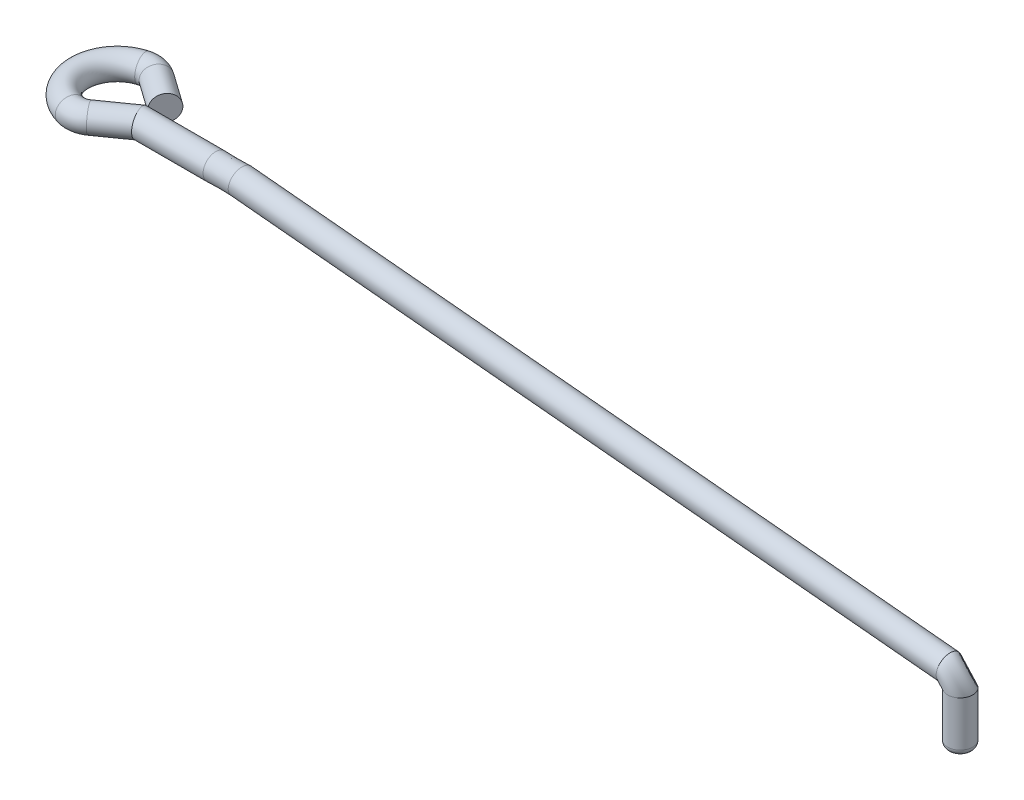
ISO-10303-21;
HEADER;
FILE_DESCRIPTION(('STEP AP214'),'2;1');
FILE_NAME('part.step','',(''),(''),'','','');
FILE_SCHEMA(('AUTOMOTIVE_DESIGN { 1 0 10303 214 1 1 1 1 }'));
ENDSEC;
DATA;
#1=APPLICATION_CONTEXT('core data for automotive mechanical design processes');
#2=APPLICATION_PROTOCOL_DEFINITION('international standard','automotive_design',2000,#1);
#3=PRODUCT_CONTEXT('',#1,'mechanical');
#4=PRODUCT('Part','Part','',(#3));
#5=PRODUCT_RELATED_PRODUCT_CATEGORY('part','',(#4));
#6=PRODUCT_DEFINITION_FORMATION('','',#4);
#7=PRODUCT_DEFINITION_CONTEXT('part definition',#1,'design');
#8=PRODUCT_DEFINITION('design','',#6,#7);
#9=PRODUCT_DEFINITION_SHAPE('','',#8);
#10=(LENGTH_UNIT() NAMED_UNIT(*) SI_UNIT(.MILLI.,.METRE.));
#11=(NAMED_UNIT(*) PLANE_ANGLE_UNIT() SI_UNIT($,.RADIAN.));
#12=(NAMED_UNIT(*) SI_UNIT($,.STERADIAN.) SOLID_ANGLE_UNIT());
#13=UNCERTAINTY_MEASURE_WITH_UNIT(LENGTH_MEASURE(1.E-05),#10,'distance_accuracy_value','');
#14=(GEOMETRIC_REPRESENTATION_CONTEXT(3) GLOBAL_UNCERTAINTY_ASSIGNED_CONTEXT((#13)) GLOBAL_UNIT_ASSIGNED_CONTEXT((#10,
#11,#12)) REPRESENTATION_CONTEXT('',''));
#15=CARTESIAN_POINT('',(0.,0.,0.));
#16=DIRECTION('',(0.,0.,1.));
#17=DIRECTION('',(1.,0.,0.));
#18=AXIS2_PLACEMENT_3D('',#15,#16,#17);
#19=CARTESIAN_POINT('',(1.4142135623731,2.7,-1.));
#20=DIRECTION('',(0.816496580927726,0.,0.577350269189625));
#21=DIRECTION('',(0.577350269189625,0.,-0.816496580927726));
#22=AXIS2_PLACEMENT_3D('',#19,#20,#21);
#23=PLANE('',#22);
#24=CARTESIAN_POINT('',(1.4142135623731,2.7,-1.));
#25=DIRECTION('',(0.816496580927726,0.,0.577350269189625));
#26=DIRECTION('',(0.577350269189625,0.,-0.816496580927726));
#27=AXIS2_PLACEMENT_3D('',#24,#25,#26);
#28=CIRCLE('',#27,0.5);
#29=CARTESIAN_POINT('',(1.70288869696791,2.7,-1.40824829046386));
#30=VERTEX_POINT('',#29);
#31=EDGE_CURVE('E180',#30,#30,#28,.T.);
#32=ORIENTED_EDGE('',*,*,#31,.T.);
#33=EDGE_LOOP('',(#32));
#34=FACE_BOUND('',#33,.T.);
#35=ADVANCED_FACE('F81',(#34),#23,.T.);
#36=CARTESIAN_POINT('',(1.13940307751542,2.7,0.));
#37=DIRECTION('',(1.,0.,0.));
#38=DIRECTION('',(0.,0.,-1.));
#39=AXIS2_PLACEMENT_3D('',#36,#37,#38);
#40=CYLINDRICAL_SURFACE('',#39,0.5);
#41=CARTESIAN_POINT('',(1.4142135623731,2.7,0.));
#42=DIRECTION('',(0.953020613871422,0.,-0.302905446527686));
#43=DIRECTION('',(-0.302905446527686,0.,-0.953020613871423));
#44=AXIS2_PLACEMENT_3D('',#41,#42,#43);
#45=ELLIPSE('',#44,0.52464762327529,0.5);
#46=CARTESIAN_POINT('',(1.2552949397752,2.7,-0.5));
#47=VERTEX_POINT('',#46);
#48=EDGE_CURVE('E165',#47,#47,#45,.T.);
#49=ORIENTED_EDGE('',*,*,#48,.T.);
#50=EDGE_LOOP('',(#49));
#51=FACE_BOUND('',#50,.T.);
#52=CARTESIAN_POINT('',(4.41421356237309,2.7,0.));
#53=DIRECTION('',(-1.,0.,0.));
#54=DIRECTION('',(0.,0.,1.));
#55=AXIS2_PLACEMENT_3D('',#52,#53,#54);
#56=CIRCLE('',#55,0.5);
#57=CARTESIAN_POINT('',(4.4142135623731,2.26819659455404,0.252082960640477));
#58=VERTEX_POINT('',#57);
#59=EDGE_CURVE('E100',#58,#58,#56,.T.);
#60=ORIENTED_EDGE('',*,*,#59,.T.);
#61=EDGE_LOOP('',(#60));
#62=FACE_BOUND('',#61,.T.);
#63=ADVANCED_FACE('F190',(#51,#62),#40,.T.);
#64=CARTESIAN_POINT('',(1.4142135623731,2.7,-1.));
#65=DIRECTION('',(-0.816496580927726,0.,-0.577350269189626));
#66=DIRECTION('',(-0.577350269189625,0.,0.816496580927726));
#67=AXIS2_PLACEMENT_3D('',#64,#65,#66);
#68=CYLINDRICAL_SURFACE('',#67,0.5);
#69=CARTESIAN_POINT('',(0.233034137605852,2.7,-1.83521998105094));
#70=DIRECTION('',(0.816496580927726,0.,0.577350269189625));
#71=DIRECTION('',(0.577350269189625,0.,-0.816496580927726));
#72=AXIS2_PLACEMENT_3D('',#69,#70,#71);
#73=CIRCLE('',#72,0.5);
#74=CARTESIAN_POINT('',(0.521709272200665,2.7,-2.2434682715148));
#75=VERTEX_POINT('',#74);
#76=EDGE_CURVE('E177',#75,#75,#73,.T.);
#77=ORIENTED_EDGE('',*,*,#76,.T.);
#78=EDGE_LOOP('',(#77));
#79=FACE_BOUND('',#78,.T.);
#80=ORIENTED_EDGE('',*,*,#31,.F.);
#81=EDGE_LOOP('',(#80));
#82=FACE_BOUND('',#81,.T.);
#83=ADVANCED_FACE('F199',(#79,#82),#68,.T.);
#84=CARTESIAN_POINT('',(-0.199978564286367,2.7,-1.22284754535515));
#85=DIRECTION('',(0.,1.,0.));
#86=DIRECTION('',(0.,0.,1.));
#87=AXIS2_PLACEMENT_3D('',#84,#85,#86);
#88=TOROIDAL_SURFACE('',#87,0.75,0.5);
#89=CARTESIAN_POINT('',(-0.399957128572734,2.7,-1.9456950907103));
#90=DIRECTION('',(0.963796727140198,0.,-0.266638085715156));
#91=DIRECTION('',(-0.266638085715156,0.,-0.963796727140198));
#92=AXIS2_PLACEMENT_3D('',#89,#90,#91);
#93=CIRCLE('',#92,0.5);
#94=CARTESIAN_POINT('',(-0.533276171430312,2.7,-2.42759345428039));
#95=VERTEX_POINT('',#94);
#96=EDGE_CURVE('E174',#95,#95,#93,.T.);
#97=CARTESIAN_POINT('',(-0.199978564286367,2.7,-1.22284754535515));
#98=DIRECTION('',(0.,1.,0.));
#99=DIRECTION('',(0.,0.,1.));
#100=AXIS2_PLACEMENT_3D('',#97,#98,#99);
#101=CIRCLE('',#100,1.25);
#102=EDGE_CURVE('',#75,#95,#101,.T.);
#103=ORIENTED_EDGE('',*,*,#76,.F.);
#104=ORIENTED_EDGE('',*,*,#96,.T.);
#105=ORIENTED_EDGE('',*,*,#102,.T.);
#106=ORIENTED_EDGE('',*,*,#102,.F.);
#107=EDGE_LOOP('',(#103,#105,#104,#106));
#108=FACE_BOUND('',#107,.T.);
#109=ADVANCED_FACE('F222',(#108),#88,.T.);
#110=CARTESIAN_POINT('',(0.,2.7,-0.499999999999999));
#111=DIRECTION('',(0.,1.,0.));
#112=DIRECTION('',(0.,0.,1.));
#113=AXIS2_PLACEMENT_3D('',#110,#111,#112);
#114=TOROIDAL_SURFACE('',#113,1.5,0.5);
#115=CARTESIAN_POINT('',(-0.399957128572734,2.7,0.945695090710298));
#116=DIRECTION('',(-0.963796727140198,0.,-0.266638085715156));
#117=DIRECTION('',(-0.266638085715156,0.,0.963796727140198));
#118=AXIS2_PLACEMENT_3D('',#115,#116,#117);
#119=CIRCLE('',#118,0.5);
#120=CARTESIAN_POINT('',(-0.533276171430312,2.7,1.4275934542804));
#121=VERTEX_POINT('',#120);
#122=EDGE_CURVE('E171',#121,#121,#119,.T.);
#123=CARTESIAN_POINT('',(0.,2.7,-0.499999999999999));
#124=DIRECTION('',(0.,1.,0.));
#125=DIRECTION('',(0.,0.,1.));
#126=AXIS2_PLACEMENT_3D('',#123,#124,#125);
#127=CIRCLE('',#126,2.);
#128=EDGE_CURVE('',#95,#121,#127,.T.);
#129=ORIENTED_EDGE('',*,*,#96,.F.);
#130=ORIENTED_EDGE('',*,*,#122,.T.);
#131=ORIENTED_EDGE('',*,*,#128,.T.);
#132=ORIENTED_EDGE('',*,*,#128,.F.);
#133=EDGE_LOOP('',(#129,#131,#130,#132));
#134=FACE_BOUND('',#133,.T.);
#135=ADVANCED_FACE('F212',(#134),#114,.T.);
#136=CARTESIAN_POINT('',(-0.199978564286367,2.7,0.222847545355149));
#137=DIRECTION('',(0.,1.,0.));
#138=DIRECTION('',(0.,0.,1.));
#139=AXIS2_PLACEMENT_3D('',#136,#137,#138);
#140=TOROIDAL_SURFACE('',#139,0.75,0.5);
#141=CARTESIAN_POINT('',(0.233034137605853,2.7,0.835219981050944));
#142=DIRECTION('',(-0.816496580927726,0.,0.577350269189626));
#143=DIRECTION('',(0.577350269189626,0.,0.816496580927726));
#144=AXIS2_PLACEMENT_3D('',#141,#142,#143);
#145=CIRCLE('',#144,0.5);
#146=CARTESIAN_POINT('',(0.521709272200666,2.7,1.24346827151481));
#147=VERTEX_POINT('',#146);
#148=EDGE_CURVE('E168',#147,#147,#145,.T.);
#149=CARTESIAN_POINT('',(-0.199978564286367,2.7,0.222847545355149));
#150=DIRECTION('',(0.,1.,0.));
#151=DIRECTION('',(0.,0.,1.));
#152=AXIS2_PLACEMENT_3D('',#149,#150,#151);
#153=CIRCLE('',#152,1.25);
#154=EDGE_CURVE('',#121,#147,#153,.T.);
#155=ORIENTED_EDGE('',*,*,#122,.F.);
#156=ORIENTED_EDGE('',*,*,#148,.T.);
#157=ORIENTED_EDGE('',*,*,#154,.T.);
#158=ORIENTED_EDGE('',*,*,#154,.F.);
#159=EDGE_LOOP('',(#155,#157,#156,#158));
#160=FACE_BOUND('',#159,.T.);
#161=ADVANCED_FACE('F143',(#160),#140,.T.);
#162=CARTESIAN_POINT('',(0.233034137605853,2.7,0.835219981050944));
#163=DIRECTION('',(0.816496580927726,0.,-0.577350269189626));
#164=DIRECTION('',(-0.577350269189626,0.,-0.816496580927726));
#165=AXIS2_PLACEMENT_3D('',#162,#163,#164);
#166=CYLINDRICAL_SURFACE('',#165,0.5);
#167=ORIENTED_EDGE('',*,*,#148,.F.);
#168=EDGE_LOOP('',(#167));
#169=FACE_BOUND('',#168,.T.);
#170=ORIENTED_EDGE('',*,*,#48,.F.);
#171=EDGE_LOOP('',(#170));
#172=FACE_BOUND('',#171,.T.);
#173=ADVANCED_FACE('F141',(#169,#172),#166,.T.);
#174=CARTESIAN_POINT('',(4.4142135623731,2.26819659455404,0.252082960640477));
#175=CARTESIAN_POINT('',(5.36755153218375,2.20597376676345,0.0613248384646829));
#176=CARTESIAN_POINT('',(4.41421356237309,2.24718968116733,0.21609934351998));
#177=CARTESIAN_POINT('',(5.36707098045403,2.20088600783081,0.0199727539925616));
#178=CARTESIAN_POINT('',(4.4142135623731,2.22780226858614,0.172840235165451));
#179=CARTESIAN_POINT('',(5.36700022224328,2.200136867423,-0.0274261489920773));
#180=CARTESIAN_POINT('',(4.41421356237309,2.20196873499894,0.069349142214526));
#181=CARTESIAN_POINT('',(5.36860649691562,2.21714302473545,-0.132716168808386));
#182=CARTESIAN_POINT('',(4.4142135623731,2.19565207595825,0.00880999201027765));
#183=CARTESIAN_POINT('',(5.3703061095665,2.23513738187058,-0.190838482226037));
#184=CARTESIAN_POINT('',(4.41421356237309,2.21096292255963,-0.123641341520671));
#185=CARTESIAN_POINT('',(5.3765418219687,2.30115691632085,-0.306511792629016));
#186=CARTESIAN_POINT('',(4.4142135623731,2.23321527856466,-0.195610592848269));
#187=CARTESIAN_POINT('',(5.38113403170364,2.34977614845408,-0.363868765709494));
#188=CARTESIAN_POINT('',(4.41421356237309,2.31552923282654,-0.329140865571219));
#189=CARTESIAN_POINT('',(5.39319949858782,2.47751720757314,-0.454104939851019));
#190=CARTESIAN_POINT('',(4.41421356237309,2.37594980511853,-0.389789578672551));
#191=CARTESIAN_POINT('',(5.40066993658484,2.55660918726882,-0.486004207254675));
#192=CARTESIAN_POINT('',(4.41421356237309,2.51988427360052,-0.473817232219377));
#193=CARTESIAN_POINT('',(5.41622394664796,2.72128459834767,-0.506445820076235));
#194=CARTESIAN_POINT('',(4.4142135623731,2.60240208350344,-0.496614666411951));
#195=CARTESIAN_POINT('',(5.424199878506,2.80572840750884,-0.494846701045549));
#196=CARTESIAN_POINT('',(4.4142135623731,2.75914883813898,-0.502645894389611));
#197=CARTESIAN_POINT('',(5.43796806155363,2.95149668166952,-0.438561994566132));
#198=CARTESIAN_POINT('',(4.4142135623731,2.83275982640182,-0.486640804842958));
#199=CARTESIAN_POINT('',(5.44373514544136,3.01255469218147,-0.39481956001816));
#200=CARTESIAN_POINT('',(4.4142135623731,2.95562606954315,-0.434856018716962));
#201=CARTESIAN_POINT('',(5.45243128269975,3.1046235523669,-0.298770197923879));
#202=CARTESIAN_POINT('',(4.4142135623731,3.00523821670322,-0.3995923866996));
#203=CARTESIAN_POINT('',(5.45541031627585,3.13616355888429,-0.246796721642954));
#204=CARTESIAN_POINT('',(4.4142135623731,3.08265786379436,-0.326216804779857));
#205=CARTESIAN_POINT('',(5.45937859881013,3.17817706890249,-0.148832975861892));
#206=CARTESIAN_POINT('',(4.41421356237309,3.11079649205926,-0.288066577760974));
#207=CARTESIAN_POINT('',(5.46039504083271,3.1889384743039,-0.102676922936804));
#208=CARTESIAN_POINT('',(4.4142135623731,3.15281031883267,-0.21609934351998));
#209=CARTESIAN_POINT('',(5.46135614429216,3.19911399216919,-0.0199727539925617));
#210=CARTESIAN_POINT('',(4.41421356237309,3.17219773141386,-0.172840235165451));
#211=CARTESIAN_POINT('',(5.46142690250291,3.19986313257701,0.0274261489920774));
#212=CARTESIAN_POINT('',(4.4142135623731,3.19803126500106,-0.0693491422145261));
#213=CARTESIAN_POINT('',(5.45982062783057,3.18285697526455,0.132716168808386));
#214=CARTESIAN_POINT('',(4.41421356237309,3.20434792404175,-0.00880999201027785));
#215=CARTESIAN_POINT('',(5.45812101517969,3.16486261812943,0.190838482226037));
#216=CARTESIAN_POINT('',(4.41421356237309,3.18903707744036,0.123641341520671));
#217=CARTESIAN_POINT('',(5.45188530277749,3.09884308367915,0.306511792629017));
#218=CARTESIAN_POINT('',(4.4142135623731,3.16678472143535,0.195610592848268));
#219=CARTESIAN_POINT('',(5.44729309304255,3.05022385154593,0.363868765709494));
#220=CARTESIAN_POINT('',(4.4142135623731,3.08447076717346,0.329140865571219));
#221=CARTESIAN_POINT('',(5.43522762615837,2.92248279242686,0.454104939851019));
#222=CARTESIAN_POINT('',(4.4142135623731,3.02405019488147,0.389789578672551));
#223=CARTESIAN_POINT('',(5.42775718816135,2.84339081273118,0.486004207254674));
#224=CARTESIAN_POINT('',(4.4142135623731,2.88011572639948,0.473817232219377));
#225=CARTESIAN_POINT('',(5.41220317809823,2.67871540165233,0.506445820076235));
#226=CARTESIAN_POINT('',(4.4142135623731,2.79759791649656,0.496614666411951));
#227=CARTESIAN_POINT('',(5.40422724624019,2.59427159249117,0.494846701045549));
#228=CARTESIAN_POINT('',(4.4142135623731,2.64085116186102,0.502645894389611));
#229=CARTESIAN_POINT('',(5.39045906319256,2.44850331833048,0.438561994566132));
#230=CARTESIAN_POINT('',(4.41421356237309,2.56724017359818,0.486640804842958));
#231=CARTESIAN_POINT('',(5.38469197930483,2.38744530781853,0.39481956001816));
#232=CARTESIAN_POINT('',(4.4142135623731,2.44437393045685,0.434856018716962));
#233=CARTESIAN_POINT('',(5.37599584204644,2.29537644763311,0.298770197923878));
#234=CARTESIAN_POINT('',(4.41421356237309,2.39476178329678,0.3995923866996));
#235=CARTESIAN_POINT('',(5.37301680847034,2.26383644111571,0.246796721642953));
#236=CARTESIAN_POINT('',(4.4142135623731,2.31734213620564,0.326216804779857));
#237=CARTESIAN_POINT('',(5.36904852593606,2.22182293109751,0.148832975861892));
#238=CARTESIAN_POINT('',(4.4142135623731,2.28920350794074,0.288066577760974));
#239=CARTESIAN_POINT('',(5.36803208391348,2.2110615256961,0.102676922936804));
#240=CARTESIAN_POINT('',(4.4142135623731,2.26819659455404,0.252082960640477));
#241=CARTESIAN_POINT('',(5.36755153218375,2.20597376676345,0.0613248384646829));
#242=B_SPLINE_SURFACE_WITH_KNOTS('',3,1,((#174,#175),(#176,#177),(#178,#179),(#180,#181),(#182,
#183),(#184,#185),(#186,#187),(#188,#189),(#190,#191),(#192,#193),(#194,#195),(#196,#197),(#198,
#199),(#200,#201),(#202,#203),(#204,#205),(#206,#207),(#208,#209),(#210,#211),(#212,#213),(#214,
#215),(#216,#217),(#218,#219),(#220,#221),(#222,#223),(#224,#225),(#226,#227),(#228,#229),(#230,
#231),(#232,#233),(#234,#235),(#236,#237),(#238,#239),(#240,#241)),.UNSPECIFIED.,.T.,.F.,.F.,(4,
2,2,2,2,2,2,2,2,2,2,2,2,2,2,2,4),(2,2),(0.,0.0625,0.125,0.1875,0.25,0.3125,0.375,0.4375,0.5,
0.5625,0.625,0.6875,0.75,0.8125,0.875,0.9375,1.),(0.,1.),.UNSPECIFIED.);
#243=CARTESIAN_POINT('',(5.41421356237309,2.7,0.));
#244=DIRECTION('',(-0.995568985100796,0.0940340146190256,0.));
#245=DIRECTION('',(0.,0.,1.));
#246=AXIS2_PLACEMENT_3D('',#243,#244,#245);
#247=CIRCLE('',#246,0.5);
#248=CARTESIAN_POINT('',(5.36755153218375,2.20597376676345,0.0613248384646829));
#249=VERTEX_POINT('',#248);
#250=EDGE_CURVE('E98',#249,#249,#247,.T.);
#251=CARTESIAN_POINT('',(4.4142135623731,2.26819659455404,0.252082960640477));
#252=CARTESIAN_POINT('',(4.42414416622529,2.26754844009788,0.250095896867813));
#253=CARTESIAN_POINT('',(4.43407477007749,2.26690028564173,0.248108833095148));
#254=CARTESIAN_POINT('',(4.45393597778187,2.26560397672943,0.244134705549819));
#255=CARTESIAN_POINT('',(4.46386658163407,2.26495582227328,0.242147641777155));
#256=CARTESIAN_POINT('',(4.48372778933846,2.26365951336097,0.238173514231826));
#257=CARTESIAN_POINT('',(4.49365839319065,2.26301135890482,0.236186450459161));
#258=CARTESIAN_POINT('',(4.51351960089504,2.26171504999252,0.232212322913832));
#259=CARTESIAN_POINT('',(4.52345020474723,2.26106689553637,0.230225259141167));
#260=CARTESIAN_POINT('',(4.54331141245162,2.25977058662406,0.226251131595838));
#261=CARTESIAN_POINT('',(4.55324201630382,2.25912243216791,0.224264067823174));
#262=CARTESIAN_POINT('',(4.57310322400821,2.25782612325561,0.220289940277845));
#263=CARTESIAN_POINT('',(4.5830338278604,2.25717796879945,0.21830287650518));
#264=CARTESIAN_POINT('',(4.60289503556479,2.25588165988715,0.214328748959851));
#265=CARTESIAN_POINT('',(4.61282563941698,2.255233505431,0.212341685187187));
#266=CARTESIAN_POINT('',(4.63268684712137,2.2539371965187,0.208367557641858));
#267=CARTESIAN_POINT('',(4.64261745097357,2.25328904206254,0.206380493869193));
#268=CARTESIAN_POINT('',(4.66247865867795,2.25199273315024,0.202406366323864));
#269=CARTESIAN_POINT('',(4.67240926253015,2.25134457869409,0.2004193025512));
#270=CARTESIAN_POINT('',(4.69227047023454,2.25004826978178,0.196445175005871));
#271=CARTESIAN_POINT('',(4.70220107408673,2.24940011532563,0.194458111233206));
#272=CARTESIAN_POINT('',(4.72206228179112,2.24810380641333,0.190483983687877));
#273=CARTESIAN_POINT('',(4.73199288564332,2.24745565195718,0.188496919915212));
#274=CARTESIAN_POINT('',(4.7518540933477,2.24615934304487,0.184522792369883));
#275=CARTESIAN_POINT('',(4.7617846971999,2.24551118858872,0.182535728597219));
#276=CARTESIAN_POINT('',(4.78164590490429,2.24421487967642,0.17856160105189));
#277=CARTESIAN_POINT('',(4.79157650875648,2.24356672522026,0.176574537279225));
#278=CARTESIAN_POINT('',(4.81143771646087,2.24227041630796,0.172600409733896));
#279=CARTESIAN_POINT('',(4.82136832031306,2.24162226185181,0.170613345961232));
#280=CARTESIAN_POINT('',(4.84122952801745,2.2403259529395,0.166639218415903));
#281=CARTESIAN_POINT('',(4.85116013186965,2.23967779848335,0.164652154643238));
#282=CARTESIAN_POINT('',(4.87102133957404,2.23838148957105,0.160678027097909));
#283=CARTESIAN_POINT('',(4.88095194342623,2.2377333351149,0.158690963325245));
#284=CARTESIAN_POINT('',(4.90081315113062,2.23643702620259,0.154716835779916));
#285=CARTESIAN_POINT('',(4.91074375498281,2.23578887174644,0.152729772007251));
#286=CARTESIAN_POINT('',(4.9306049626872,2.23449256283414,0.148755644461922));
#287=CARTESIAN_POINT('',(4.9405355665394,2.23384440837799,0.146768580689257));
#288=CARTESIAN_POINT('',(4.96039677424378,2.23254809946568,0.142794453143928));
#289=CARTESIAN_POINT('',(4.97032737809598,2.23189994500953,0.140807389371264));
#290=CARTESIAN_POINT('',(4.99018858580037,2.23060363609723,0.136833261825935));
#291=CARTESIAN_POINT('',(5.00011918965256,2.22995548164108,0.13484619805327));
#292=CARTESIAN_POINT('',(5.01998039735695,2.22865917272877,0.130872070507941));
#293=CARTESIAN_POINT('',(5.02991100120914,2.22801101827262,0.128885006735277));
#294=CARTESIAN_POINT('',(5.04977220891353,2.22671470936032,0.124910879189948));
#295=CARTESIAN_POINT('',(5.05970281276573,2.22606655490416,0.122923815417283));
#296=CARTESIAN_POINT('',(5.07956402047012,2.22477024599186,0.118949687871954));
#297=CARTESIAN_POINT('',(5.08949462432231,2.22412209153571,0.11696262409929));
#298=CARTESIAN_POINT('',(5.1093558320267,2.2228257826234,0.112988496553961));
#299=CARTESIAN_POINT('',(5.11928643587889,2.22217762816725,0.111001432781296));
#300=CARTESIAN_POINT('',(5.13914764358328,2.22088131925495,0.107027305235967));
#301=CARTESIAN_POINT('',(5.14907824743548,2.2202331647988,0.105040241463302));
#302=CARTESIAN_POINT('',(5.16893945513986,2.21893685588649,0.101066113917973));
#303=CARTESIAN_POINT('',(5.17887005899206,2.21828870143034,0.0990790501453089));
#304=CARTESIAN_POINT('',(5.19873126669645,2.21699239251804,0.0951049225999798));
#305=CARTESIAN_POINT('',(5.20866187054864,2.21634423806189,0.0931178588273153));
#306=CARTESIAN_POINT('',(5.22852307825303,2.21504792914958,0.0891437312819862));
#307=CARTESIAN_POINT('',(5.23845368210522,2.21439977469343,0.0871566675093218));
#308=CARTESIAN_POINT('',(5.25831488980961,2.21310346578113,0.0831825399639927));
#309=CARTESIAN_POINT('',(5.26824549366181,2.21245531132497,0.0811954761913282));
#310=CARTESIAN_POINT('',(5.2881067013662,2.21115900241267,0.0772213486459991));
#311=CARTESIAN_POINT('',(5.29803730521839,2.21051084795652,0.0752342848733345));
#312=CARTESIAN_POINT('',(5.31789851292278,2.20921453904421,0.0712601573280055));
#313=CARTESIAN_POINT('',(5.32782911677497,2.20856638458806,0.069273093555341));
#314=CARTESIAN_POINT('',(5.34769032447936,2.20727007567576,0.065298966010012));
#315=CARTESIAN_POINT('',(5.35762092833156,2.20662192121961,0.0633119022373475));
#316=CARTESIAN_POINT('',(5.36755153218375,2.20597376676345,0.0613248384646829));
#317=B_SPLINE_CURVE_WITH_KNOTS('',3,(#251,#252,#253,#254,#255,#256,#257,#258,#259,#260,#261,
#262,#263,#264,#265,#266,#267,#268,#269,#270,#271,#272,#273,#274,#275,#276,#277,#278,#279,#280,
#281,#282,#283,#284,#285,#286,#287,#288,#289,#290,#291,#292,#293,#294,#295,#296,#297,#298,#299,
#300,#301,#302,#303,#304,#305,#306,#307,#308,#309,#310,#311,#312,#313,#314,#315,#316),
.UNSPECIFIED.,.F.,.F.,(4,2,2,2,2,2,2,2,2,2,2,2,2,2,2,2,2,2,2,2,2,2,2,2,2,2,2,2,2,2,2,2,4),(0.,
0.0304445196306983,0.0608890392613958,0.0913335588920932,0.121778078522791,0.152222598153488,
0.182667117784187,0.213111637414884,0.243556157045581,0.27400067667628,0.304445196306977,
0.334889715937675,0.365334235568373,0.395778755199071,0.426223274829768,0.456667794460465,
0.487112314091164,0.517556833721861,0.548001353352559,0.578445872983256,0.608890392613954,
0.639334912244652,0.669779431875349,0.700223951506047,0.730668471136745,0.761112990767442,
0.79155751039814,0.822002030028837,0.852446549659535,0.882891069290233,0.91333558892093,
0.943780108551629,0.974224628182326),.UNSPECIFIED.);
#318=EDGE_CURVE('BSEAM132',#58,#249,#317,.T.);
#319=ORIENTED_EDGE('',*,*,#59,.F.);
#320=ORIENTED_EDGE('',*,*,#250,.T.);
#321=ORIENTED_EDGE('',*,*,#318,.T.);
#322=ORIENTED_EDGE('',*,*,#318,.F.);
#323=EDGE_LOOP('',(#319,#321,#320,#322));
#324=FACE_BOUND('',#323,.T.);
#325=ADVANCED_FACE('F132',(#324),#242,.T.);
#326=CARTESIAN_POINT('',(34.,-2.5,0.));
#327=DIRECTION('',(0.,1.,0.));
#328=DIRECTION('',(0.,0.,1.));
#329=AXIS2_PLACEMENT_3D('',#326,#327,#328);
#330=PLANE('',#329);
#331=CARTESIAN_POINT('',(34.,-2.5,0.));
#332=DIRECTION('',(0.,1.,0.));
#333=DIRECTION('',(0.,0.,1.));
#334=AXIS2_PLACEMENT_3D('',#331,#332,#333);
#335=CIRCLE('',#334,0.25);
#336=CARTESIAN_POINT('',(34.,-2.5,0.25));
#337=VERTEX_POINT('',#336);
#338=EDGE_CURVE('E12',#337,#337,#335,.F.);
#339=ORIENTED_EDGE('',*,*,#338,.T.);
#340=EDGE_LOOP('',(#339));
#341=FACE_BOUND('',#340,.T.);
#342=ADVANCED_FACE('F128',(#341),#330,.F.);
#343=CARTESIAN_POINT('',(34.,-2.5,0.));
#344=DIRECTION('',(0.,1.,0.));
#345=DIRECTION('',(0.,0.,1.));
#346=AXIS2_PLACEMENT_3D('',#343,#344,#345);
#347=CYLINDRICAL_SURFACE('',#346,0.5);
#348=CARTESIAN_POINT('',(34.,-2.25,0.));
#349=DIRECTION('',(0.,1.,0.));
#350=DIRECTION('',(0.,0.,1.));
#351=AXIS2_PLACEMENT_3D('',#348,#349,#350);
#352=CIRCLE('',#351,0.5);
#353=CARTESIAN_POINT('',(34.,-2.25,0.5));
#354=VERTEX_POINT('',#353);
#355=EDGE_CURVE('E88',#354,#354,#352,.T.);
#356=ORIENTED_EDGE('',*,*,#355,.T.);
#357=EDGE_LOOP('',(#356));
#358=FACE_BOUND('',#357,.T.);
#359=CARTESIAN_POINT('',(34.,-0.45499910048386,0.));
#360=DIRECTION('',(0.,1.,0.));
#361=DIRECTION('',(0.,0.,1.));
#362=AXIS2_PLACEMENT_3D('',#359,#360,#361);
#363=CIRCLE('',#362,0.5);
#364=CARTESIAN_POINT('',(33.5,-0.454999100483856,0.));
#365=VERTEX_POINT('',#364);
#366=EDGE_CURVE('E96',#365,#365,#363,.T.);
#367=ORIENTED_EDGE('',*,*,#366,.F.);
#368=EDGE_LOOP('',(#367));
#369=FACE_BOUND('',#368,.T.);
#370=ADVANCED_FACE('F125',(#358,#369),#347,.T.);
#371=CARTESIAN_POINT('',(5.41421356237309,2.7,0.));
#372=DIRECTION('',(0.995568985100796,-0.0940340146190255,0.));
#373=DIRECTION('',(0.0940340146190256,0.995568985100796,0.));
#374=AXIS2_PLACEMENT_3D('',#371,#372,#373);
#375=CYLINDRICAL_SURFACE('',#374,0.5);
#376=CARTESIAN_POINT('',(33.5470170073095,0.0427853920665425,0.));
#377=DIRECTION('',(-0.995568985100796,0.0940340146190256,0.));
#378=DIRECTION('',(0.,0.,1.));
#379=AXIS2_PLACEMENT_3D('',#376,#377,#378);
#380=CIRCLE('',#379,0.5);
#381=EDGE_CURVE('E93',#365,#365,#380,.T.);
#382=ORIENTED_EDGE('',*,*,#381,.T.);
#383=EDGE_LOOP('',(#382));
#384=FACE_BOUND('',#383,.T.);
#385=ORIENTED_EDGE('',*,*,#250,.F.);
#386=EDGE_LOOP('',(#385));
#387=FACE_BOUND('',#386,.T.);
#388=ADVANCED_FACE('F116',(#384,#387),#375,.T.);
#389=CARTESIAN_POINT('',(33.5,-0.454999100483856,0.));
#390=DIRECTION('',(0.,0.,-1.));
#391=DIRECTION('',(-1.,0.,0.));
#392=AXIS2_PLACEMENT_3D('',#389,#390,#391);
#393=TOROIDAL_SURFACE('',#392,0.500000000000001,0.5);
#394=ORIENTED_EDGE('',*,*,#366,.T.);
#395=ORIENTED_EDGE('',*,*,#381,.F.);
#396=EDGE_LOOP('',(#394,#395));
#397=FACE_BOUND('',#396,.T.);
#398=ADVANCED_FACE('F94',(#397),#393,.T.);
#399=CARTESIAN_POINT('',(34.,-2.25,0.));
#400=DIRECTION('',(0.,1.,0.));
#401=DIRECTION('',(0.,0.,1.));
#402=AXIS2_PLACEMENT_3D('',#399,#400,#401);
#403=TOROIDAL_SURFACE('',#402,0.25,0.25);
#404=ORIENTED_EDGE('',*,*,#338,.F.);
#405=EDGE_LOOP('',(#404));
#406=FACE_BOUND('',#405,.T.);
#407=ORIENTED_EDGE('',*,*,#355,.F.);
#408=EDGE_LOOP('',(#407));
#409=FACE_BOUND('',#408,.T.);
#410=ADVANCED_FACE('F83',(#406,#409),#403,.T.);
#411=CLOSED_SHELL('',(#35,#63,#83,#109,#135,#161,#173,#325,#342,#370,#388,#398,#410));
#412=MANIFOLD_SOLID_BREP('B2',#411);
#413=ADVANCED_BREP_SHAPE_REPRESENTATION('',(#18,#412),#14);
#414=SHAPE_DEFINITION_REPRESENTATION(#9,#413);
ENDSEC;
END-ISO-10303-21;
